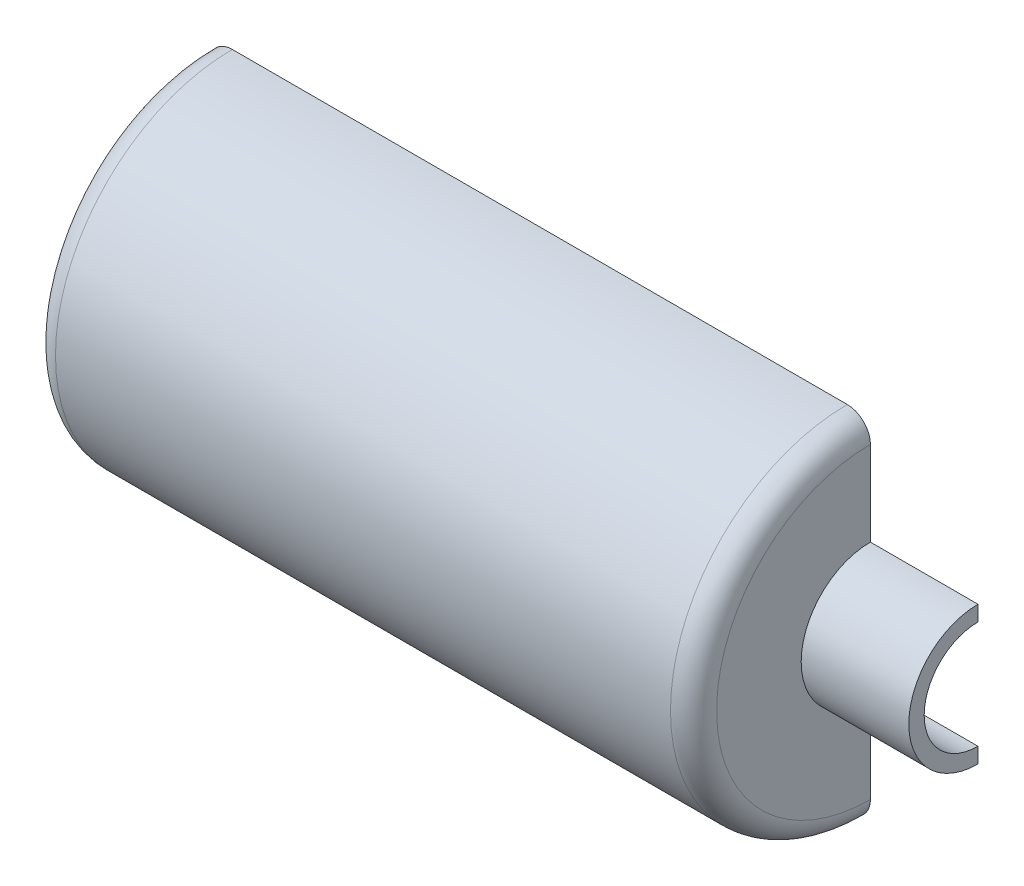
ISO-10303-21;
HEADER;
FILE_DESCRIPTION(('STEP AP214'),'2;1');
FILE_NAME('part.step','',(''),(''),'','','');
FILE_SCHEMA(('AUTOMOTIVE_DESIGN { 1 0 10303 214 1 1 1 1 }'));
ENDSEC;
DATA;
#1=APPLICATION_CONTEXT('core data for automotive mechanical design processes');
#2=APPLICATION_PROTOCOL_DEFINITION('international standard','automotive_design',2000,#1);
#3=PRODUCT_CONTEXT('',#1,'mechanical');
#4=PRODUCT('Part','Part','',(#3));
#5=PRODUCT_RELATED_PRODUCT_CATEGORY('part','',(#4));
#6=PRODUCT_DEFINITION_FORMATION('','',#4);
#7=PRODUCT_DEFINITION_CONTEXT('part definition',#1,'design');
#8=PRODUCT_DEFINITION('design','',#6,#7);
#9=PRODUCT_DEFINITION_SHAPE('','',#8);
#10=(LENGTH_UNIT() NAMED_UNIT(*) SI_UNIT(.MILLI.,.METRE.));
#11=(NAMED_UNIT(*) PLANE_ANGLE_UNIT() SI_UNIT($,.RADIAN.));
#12=(NAMED_UNIT(*) SI_UNIT($,.STERADIAN.) SOLID_ANGLE_UNIT());
#13=UNCERTAINTY_MEASURE_WITH_UNIT(LENGTH_MEASURE(1.E-05),#10,'distance_accuracy_value','');
#14=(GEOMETRIC_REPRESENTATION_CONTEXT(3) GLOBAL_UNCERTAINTY_ASSIGNED_CONTEXT((#13)) GLOBAL_UNIT_ASSIGNED_CONTEXT((#10,
#11,#12)) REPRESENTATION_CONTEXT('',''));
#15=CARTESIAN_POINT('',(0.,0.,0.));
#16=DIRECTION('',(0.,0.,1.));
#17=DIRECTION('',(1.,0.,0.));
#18=AXIS2_PLACEMENT_3D('',#15,#16,#17);
#19=CARTESIAN_POINT('',(-200.,0.,0.));
#20=DIRECTION('',(-1.,0.,0.));
#21=DIRECTION('',(0.,0.,1.));
#22=AXIS2_PLACEMENT_3D('',#19,#20,#21);
#23=PLANE('',#22);
#24=CARTESIAN_POINT('',(-200.,0.,0.));
#25=DIRECTION('',(-1.,0.,0.));
#26=DIRECTION('',(0.,0.,1.));
#27=AXIS2_PLACEMENT_3D('',#24,#25,#26);
#28=CIRCLE('',#27,92.5);
#29=CARTESIAN_POINT('',(-200.,-92.5,-6.45924047685979E-13));
#30=VERTEX_POINT('',#29);
#31=CARTESIAN_POINT('',(-200.,92.5,0.));
#32=VERTEX_POINT('',#31);
#33=EDGE_CURVE('E11',#30,#32,#28,.T.);
#34=ORIENTED_EDGE('',*,*,#33,.F.);
#35=DIRECTION('',(0.,-1.,0.));
#36=VECTOR('',#35,1.);
#37=CARTESIAN_POINT('',(-200.,0.,0.));
#38=LINE('',#37,#36);
#39=EDGE_CURVE('E123',#32,#30,#38,.T.);
#40=ORIENTED_EDGE('',*,*,#39,.F.);
#41=EDGE_LOOP('',(#34,#40));
#42=FACE_BOUND('',#41,.T.);
#43=ADVANCED_FACE('F33',(#42),#23,.F.);
#44=CARTESIAN_POINT('',(-192.5,0.,0.));
#45=DIRECTION('',(-1.,0.,0.));
#46=DIRECTION('',(0.,0.,1.));
#47=AXIS2_PLACEMENT_3D('',#44,#45,#46);
#48=TOROIDAL_SURFACE('',#47,92.5,7.50000000000001);
#49=CARTESIAN_POINT('',(-192.5,0.,0.));
#50=DIRECTION('',(-1.,0.,0.));
#51=DIRECTION('',(0.,0.,1.));
#52=AXIS2_PLACEMENT_3D('',#49,#50,#51);
#53=CIRCLE('',#52,100.);
#54=CARTESIAN_POINT('',(-192.5,-100.,-6.98296267768627E-13));
#55=VERTEX_POINT('',#54);
#56=CARTESIAN_POINT('',(-192.5,100.,0.));
#57=VERTEX_POINT('',#56);
#58=EDGE_CURVE('E40',#55,#57,#53,.T.);
#59=ORIENTED_EDGE('',*,*,#58,.F.);
#60=CARTESIAN_POINT('',(-192.5,-92.5,-6.4592404768598E-13));
#61=DIRECTION('',(0.,0.,1.));
#62=DIRECTION('',(1.,0.,0.));
#63=AXIS2_PLACEMENT_3D('',#60,#61,#62);
#64=CIRCLE('',#63,7.50000000000001);
#65=EDGE_CURVE('E128',#30,#55,#64,.T.);
#66=ORIENTED_EDGE('',*,*,#65,.F.);
#67=ORIENTED_EDGE('',*,*,#33,.T.);
#68=CARTESIAN_POINT('',(-192.5,92.5,0.));
#69=DIRECTION('',(0.,0.,-1.));
#70=DIRECTION('',(1.,0.,0.));
#71=AXIS2_PLACEMENT_3D('',#68,#69,#70);
#72=CIRCLE('',#71,7.50000000000001);
#73=EDGE_CURVE('E134',#32,#57,#72,.T.);
#74=ORIENTED_EDGE('',*,*,#73,.T.);
#75=EDGE_LOOP('',(#59,#66,#67,#74));
#76=FACE_BOUND('',#75,.T.);
#77=ADVANCED_FACE('F133',(#76),#48,.F.);
#78=CARTESIAN_POINT('',(0.,0.,0.));
#79=DIRECTION('',(-1.,0.,0.));
#80=DIRECTION('',(0.,0.,1.));
#81=AXIS2_PLACEMENT_3D('',#78,#79,#80);
#82=CYLINDRICAL_SURFACE('',#81,100.);
#83=CARTESIAN_POINT('',(192.5,0.,0.));
#84=DIRECTION('',(-1.,0.,0.));
#85=DIRECTION('',(0.,0.,1.));
#86=AXIS2_PLACEMENT_3D('',#83,#84,#85);
#87=CIRCLE('',#86,100.);
#88=CARTESIAN_POINT('',(192.5,-100.,-6.98296267768627E-13));
#89=VERTEX_POINT('',#88);
#90=CARTESIAN_POINT('',(192.5,100.,0.));
#91=VERTEX_POINT('',#90);
#92=EDGE_CURVE('E214',#89,#91,#87,.T.);
#93=ORIENTED_EDGE('',*,*,#92,.F.);
#94=DIRECTION('',(1.,0.,0.));
#95=VECTOR('',#94,1.);
#96=CARTESIAN_POINT('',(-192.5,-100.,-6.98296267768627E-13));
#97=LINE('',#96,#95);
#98=EDGE_CURVE('E168',#55,#89,#97,.T.);
#99=ORIENTED_EDGE('',*,*,#98,.F.);
#100=ORIENTED_EDGE('',*,*,#58,.T.);
#101=DIRECTION('',(1.,0.,0.));
#102=VECTOR('',#101,1.);
#103=CARTESIAN_POINT('',(-192.5,100.,0.));
#104=LINE('',#103,#102);
#105=EDGE_CURVE('E139',#57,#91,#104,.T.);
#106=ORIENTED_EDGE('',*,*,#105,.T.);
#107=EDGE_LOOP('',(#93,#99,#100,#106));
#108=FACE_BOUND('',#107,.T.);
#109=ADVANCED_FACE('F217',(#108),#82,.F.);
#110=CARTESIAN_POINT('',(192.5,0.,0.));
#111=DIRECTION('',(-1.,0.,0.));
#112=DIRECTION('',(0.,0.,1.));
#113=AXIS2_PLACEMENT_3D('',#110,#111,#112);
#114=TOROIDAL_SURFACE('',#113,92.5,7.50000000000001);
#115=CARTESIAN_POINT('',(200.,0.,0.));
#116=DIRECTION('',(-1.,0.,0.));
#117=DIRECTION('',(0.,0.,1.));
#118=AXIS2_PLACEMENT_3D('',#115,#116,#117);
#119=CIRCLE('',#118,92.5);
#120=CARTESIAN_POINT('',(200.,-92.5,-6.45924047685979E-13));
#121=VERTEX_POINT('',#120);
#122=CARTESIAN_POINT('',(200.,92.5,0.));
#123=VERTEX_POINT('',#122);
#124=EDGE_CURVE('E212',#121,#123,#119,.T.);
#125=ORIENTED_EDGE('',*,*,#124,.F.);
#126=CARTESIAN_POINT('',(192.5,-92.5,-6.4592404768598E-13));
#127=DIRECTION('',(0.,0.,1.));
#128=DIRECTION('',(1.,0.,0.));
#129=AXIS2_PLACEMENT_3D('',#126,#127,#128);
#130=CIRCLE('',#129,7.50000000000001);
#131=EDGE_CURVE('E171',#89,#121,#130,.T.);
#132=ORIENTED_EDGE('',*,*,#131,.F.);
#133=ORIENTED_EDGE('',*,*,#92,.T.);
#134=CARTESIAN_POINT('',(192.5,92.5,0.));
#135=DIRECTION('',(0.,0.,-1.));
#136=DIRECTION('',(1.,0.,0.));
#137=AXIS2_PLACEMENT_3D('',#134,#135,#136);
#138=CIRCLE('',#137,7.50000000000001);
#139=EDGE_CURVE('E141',#91,#123,#138,.T.);
#140=ORIENTED_EDGE('',*,*,#139,.T.);
#141=EDGE_LOOP('',(#125,#132,#133,#140));
#142=FACE_BOUND('',#141,.T.);
#143=ADVANCED_FACE('F221',(#142),#114,.F.);
#144=CARTESIAN_POINT('',(200.,-92.5,-6.45924047685979E-13));
#145=DIRECTION('',(1.,0.,0.));
#146=DIRECTION('',(0.,0.,-1.));
#147=AXIS2_PLACEMENT_3D('',#144,#145,#146);
#148=PLANE('',#147);
#149=CARTESIAN_POINT('',(200.,0.,0.));
#150=DIRECTION('',(-1.,0.,0.));
#151=DIRECTION('',(0.,0.,1.));
#152=AXIS2_PLACEMENT_3D('',#149,#150,#151);
#153=CIRCLE('',#152,35.);
#154=CARTESIAN_POINT('',(200.,-35.,-2.44403693719019E-13));
#155=VERTEX_POINT('',#154);
#156=CARTESIAN_POINT('',(200.,35.,0.));
#157=VERTEX_POINT('',#156);
#158=EDGE_CURVE('E210',#155,#157,#153,.T.);
#159=ORIENTED_EDGE('',*,*,#158,.F.);
#160=DIRECTION('',(0.,1.,0.));
#161=VECTOR('',#160,1.);
#162=CARTESIAN_POINT('',(200.,-92.5,-6.45924047685979E-13));
#163=LINE('',#162,#161);
#164=EDGE_CURVE('E174',#121,#155,#163,.T.);
#165=ORIENTED_EDGE('',*,*,#164,.F.);
#166=ORIENTED_EDGE('',*,*,#124,.T.);
#167=DIRECTION('',(0.,-1.,0.));
#168=VECTOR('',#167,1.);
#169=CARTESIAN_POINT('',(200.,92.5,0.));
#170=LINE('',#169,#168);
#171=EDGE_CURVE('E146',#123,#157,#170,.T.);
#172=ORIENTED_EDGE('',*,*,#171,.T.);
#173=EDGE_LOOP('',(#159,#165,#166,#172));
#174=FACE_BOUND('',#173,.T.);
#175=ADVANCED_FACE('F224',(#174),#148,.F.);
#176=CARTESIAN_POINT('',(0.,0.,0.));
#177=DIRECTION('',(-1.,0.,0.));
#178=DIRECTION('',(0.,0.,1.));
#179=AXIS2_PLACEMENT_3D('',#176,#177,#178);
#180=CYLINDRICAL_SURFACE('',#179,35.);
#181=CARTESIAN_POINT('',(285.,0.,0.));
#182=DIRECTION('',(-1.,0.,0.));
#183=DIRECTION('',(0.,0.,1.));
#184=AXIS2_PLACEMENT_3D('',#181,#182,#183);
#185=CIRCLE('',#184,35.);
#186=CARTESIAN_POINT('',(285.,-35.,-2.44403693719019E-13));
#187=VERTEX_POINT('',#186);
#188=CARTESIAN_POINT('',(285.,35.,0.));
#189=VERTEX_POINT('',#188);
#190=EDGE_CURVE('E208',#187,#189,#185,.T.);
#191=ORIENTED_EDGE('',*,*,#190,.F.);
#192=DIRECTION('',(1.,0.,0.));
#193=VECTOR('',#192,1.);
#194=CARTESIAN_POINT('',(200.,-35.,-2.44403693719019E-13));
#195=LINE('',#194,#193);
#196=EDGE_CURVE('E177',#155,#187,#195,.T.);
#197=ORIENTED_EDGE('',*,*,#196,.F.);
#198=ORIENTED_EDGE('',*,*,#158,.T.);
#199=DIRECTION('',(1.,0.,0.));
#200=VECTOR('',#199,1.);
#201=CARTESIAN_POINT('',(200.,35.,0.));
#202=LINE('',#201,#200);
#203=EDGE_CURVE('E149',#157,#189,#202,.T.);
#204=ORIENTED_EDGE('',*,*,#203,.T.);
#205=EDGE_LOOP('',(#191,#197,#198,#204));
#206=FACE_BOUND('',#205,.T.);
#207=ADVANCED_FACE('F229',(#206),#180,.F.);
#208=CARTESIAN_POINT('',(285.,-35.,-2.44403693719019E-13));
#209=DIRECTION('',(-1.,0.,0.));
#210=DIRECTION('',(0.,0.,1.));
#211=AXIS2_PLACEMENT_3D('',#208,#209,#210);
#212=PLANE('',#211);
#213=CARTESIAN_POINT('',(285.,0.,0.));
#214=DIRECTION('',(-1.,0.,0.));
#215=DIRECTION('',(0.,0.,1.));
#216=AXIS2_PLACEMENT_3D('',#213,#214,#215);
#217=CIRCLE('',#216,45.);
#218=CARTESIAN_POINT('',(285.,-45.,-3.14233320495882E-13));
#219=VERTEX_POINT('',#218);
#220=CARTESIAN_POINT('',(285.,45.,0.));
#221=VERTEX_POINT('',#220);
#222=EDGE_CURVE('E206',#219,#221,#217,.T.);
#223=ORIENTED_EDGE('',*,*,#222,.F.);
#224=DIRECTION('',(0.,-1.,0.));
#225=VECTOR('',#224,1.);
#226=CARTESIAN_POINT('',(285.,-35.,-2.44403693719019E-13));
#227=LINE('',#226,#225);
#228=EDGE_CURVE('E180',#187,#219,#227,.T.);
#229=ORIENTED_EDGE('',*,*,#228,.F.);
#230=ORIENTED_EDGE('',*,*,#190,.T.);
#231=DIRECTION('',(0.,1.,0.));
#232=VECTOR('',#231,1.);
#233=CARTESIAN_POINT('',(285.,35.,0.));
#234=LINE('',#233,#232);
#235=EDGE_CURVE('E152',#189,#221,#234,.T.);
#236=ORIENTED_EDGE('',*,*,#235,.T.);
#237=EDGE_LOOP('',(#223,#229,#230,#236));
#238=FACE_BOUND('',#237,.T.);
#239=ADVANCED_FACE('F232',(#238),#212,.F.);
#240=CARTESIAN_POINT('',(0.,0.,0.));
#241=DIRECTION('',(-1.,0.,0.));
#242=DIRECTION('',(0.,0.,1.));
#243=AXIS2_PLACEMENT_3D('',#240,#241,#242);
#244=CYLINDRICAL_SURFACE('',#243,45.);
#245=CARTESIAN_POINT('',(215.,0.,0.));
#246=DIRECTION('',(-1.,0.,0.));
#247=DIRECTION('',(0.,0.,1.));
#248=AXIS2_PLACEMENT_3D('',#245,#246,#247);
#249=CIRCLE('',#248,45.);
#250=CARTESIAN_POINT('',(215.,-45.,-3.14233320495882E-13));
#251=VERTEX_POINT('',#250);
#252=CARTESIAN_POINT('',(215.,45.,0.));
#253=VERTEX_POINT('',#252);
#254=EDGE_CURVE('E204',#251,#253,#249,.T.);
#255=ORIENTED_EDGE('',*,*,#254,.F.);
#256=DIRECTION('',(-1.,0.,0.));
#257=VECTOR('',#256,1.);
#258=CARTESIAN_POINT('',(215.,-45.,-3.14233320495882E-13));
#259=LINE('',#258,#257);
#260=EDGE_CURVE('E183',#219,#251,#259,.T.);
#261=ORIENTED_EDGE('',*,*,#260,.F.);
#262=ORIENTED_EDGE('',*,*,#222,.T.);
#263=DIRECTION('',(-1.,0.,0.));
#264=VECTOR('',#263,1.);
#265=CARTESIAN_POINT('',(215.,45.,0.));
#266=LINE('',#265,#264);
#267=EDGE_CURVE('E155',#221,#253,#266,.T.);
#268=ORIENTED_EDGE('',*,*,#267,.T.);
#269=EDGE_LOOP('',(#255,#261,#262,#268));
#270=FACE_BOUND('',#269,.T.);
#271=ADVANCED_FACE('F237',(#270),#244,.T.);
#272=CARTESIAN_POINT('',(215.,-99.9999999999999,-6.98296267768626E-13));
#273=DIRECTION('',(-1.,0.,0.));
#274=DIRECTION('',(0.,0.,1.));
#275=AXIS2_PLACEMENT_3D('',#272,#273,#274);
#276=PLANE('',#275);
#277=CARTESIAN_POINT('',(215.,0.,0.));
#278=DIRECTION('',(-1.,0.,0.));
#279=DIRECTION('',(0.,0.,1.));
#280=AXIS2_PLACEMENT_3D('',#277,#278,#279);
#281=CIRCLE('',#280,99.9999999999999);
#282=CARTESIAN_POINT('',(215.,-99.9999999999999,-6.98296267768626E-13));
#283=VERTEX_POINT('',#282);
#284=CARTESIAN_POINT('',(215.,99.9999999999999,0.));
#285=VERTEX_POINT('',#284);
#286=EDGE_CURVE('E202',#283,#285,#281,.T.);
#287=ORIENTED_EDGE('',*,*,#286,.F.);
#288=DIRECTION('',(0.,-1.,0.));
#289=VECTOR('',#288,1.);
#290=CARTESIAN_POINT('',(215.,-99.9999999999999,-6.98296267768626E-13));
#291=LINE('',#290,#289);
#292=EDGE_CURVE('E186',#251,#283,#291,.T.);
#293=ORIENTED_EDGE('',*,*,#292,.F.);
#294=ORIENTED_EDGE('',*,*,#254,.T.);
#295=DIRECTION('',(0.,1.,0.));
#296=VECTOR('',#295,1.);
#297=CARTESIAN_POINT('',(215.,99.9999999999999,0.));
#298=LINE('',#297,#296);
#299=EDGE_CURVE('E158',#253,#285,#298,.T.);
#300=ORIENTED_EDGE('',*,*,#299,.T.);
#301=EDGE_LOOP('',(#287,#293,#294,#300));
#302=FACE_BOUND('',#301,.T.);
#303=ADVANCED_FACE('F240',(#302),#276,.F.);
#304=CARTESIAN_POINT('',(200.,0.,0.));
#305=DIRECTION('',(-1.,0.,0.));
#306=DIRECTION('',(0.,0.,1.));
#307=AXIS2_PLACEMENT_3D('',#304,#305,#306);
#308=TOROIDAL_SURFACE('',#307,100.,15.);
#309=CARTESIAN_POINT('',(200.,0.,0.));
#310=DIRECTION('',(-1.,0.,0.));
#311=DIRECTION('',(0.,0.,1.));
#312=AXIS2_PLACEMENT_3D('',#309,#310,#311);
#313=CIRCLE('',#312,115.);
#314=CARTESIAN_POINT('',(200.,-115.,-8.03040707933921E-13));
#315=VERTEX_POINT('',#314);
#316=CARTESIAN_POINT('',(200.,115.,0.));
#317=VERTEX_POINT('',#316);
#318=EDGE_CURVE('E200',#315,#317,#313,.T.);
#319=ORIENTED_EDGE('',*,*,#318,.F.);
#320=CARTESIAN_POINT('',(200.,-100.,-6.98296267768627E-13));
#321=DIRECTION('',(0.,0.,-1.));
#322=DIRECTION('',(1.,0.,0.));
#323=AXIS2_PLACEMENT_3D('',#320,#321,#322);
#324=CIRCLE('',#323,15.);
#325=EDGE_CURVE('E189',#283,#315,#324,.T.);
#326=ORIENTED_EDGE('',*,*,#325,.F.);
#327=ORIENTED_EDGE('',*,*,#286,.T.);
#328=CARTESIAN_POINT('',(200.,100.,0.));
#329=DIRECTION('',(0.,0.,1.));
#330=DIRECTION('',(1.,0.,0.));
#331=AXIS2_PLACEMENT_3D('',#328,#329,#330);
#332=CIRCLE('',#331,15.);
#333=EDGE_CURVE('E161',#285,#317,#332,.T.);
#334=ORIENTED_EDGE('',*,*,#333,.T.);
#335=EDGE_LOOP('',(#319,#326,#327,#334));
#336=FACE_BOUND('',#335,.T.);
#337=ADVANCED_FACE('F244',(#336),#308,.T.);
#338=CARTESIAN_POINT('',(0.,0.,0.));
#339=DIRECTION('',(-1.,0.,0.));
#340=DIRECTION('',(0.,0.,1.));
#341=AXIS2_PLACEMENT_3D('',#338,#339,#340);
#342=CYLINDRICAL_SURFACE('',#341,115.);
#343=CARTESIAN_POINT('',(-200.,0.,0.));
#344=DIRECTION('',(-1.,0.,0.));
#345=DIRECTION('',(0.,0.,1.));
#346=AXIS2_PLACEMENT_3D('',#343,#344,#345);
#347=CIRCLE('',#346,115.);
#348=CARTESIAN_POINT('',(-200.,-115.,-8.03040707933921E-13));
#349=VERTEX_POINT('',#348);
#350=CARTESIAN_POINT('',(-200.,115.,0.));
#351=VERTEX_POINT('',#350);
#352=EDGE_CURVE('E55',#349,#351,#347,.T.);
#353=ORIENTED_EDGE('',*,*,#352,.F.);
#354=DIRECTION('',(-1.,0.,0.));
#355=VECTOR('',#354,1.);
#356=CARTESIAN_POINT('',(-200.,-115.,-8.03040707933921E-13));
#357=LINE('',#356,#355);
#358=EDGE_CURVE('E192',#315,#349,#357,.T.);
#359=ORIENTED_EDGE('',*,*,#358,.F.);
#360=ORIENTED_EDGE('',*,*,#318,.T.);
#361=DIRECTION('',(-1.,0.,0.));
#362=VECTOR('',#361,1.);
#363=CARTESIAN_POINT('',(-200.,115.,0.));
#364=LINE('',#363,#362);
#365=EDGE_CURVE('E164',#317,#351,#364,.T.);
#366=ORIENTED_EDGE('',*,*,#365,.T.);
#367=EDGE_LOOP('',(#353,#359,#360,#366));
#368=FACE_BOUND('',#367,.T.);
#369=ADVANCED_FACE('F246',(#368),#342,.T.);
#370=CARTESIAN_POINT('',(-200.,0.,0.));
#371=DIRECTION('',(-1.,0.,0.));
#372=DIRECTION('',(0.,0.,1.));
#373=AXIS2_PLACEMENT_3D('',#370,#371,#372);
#374=TOROIDAL_SURFACE('',#373,100.,15.);
#375=CARTESIAN_POINT('',(-215.,0.,0.));
#376=DIRECTION('',(-1.,0.,0.));
#377=DIRECTION('',(0.,0.,1.));
#378=AXIS2_PLACEMENT_3D('',#375,#376,#377);
#379=CIRCLE('',#378,99.9999999999999);
#380=CARTESIAN_POINT('',(-215.,-99.9999999999999,-6.98296267768626E-13));
#381=VERTEX_POINT('',#380);
#382=CARTESIAN_POINT('',(-215.,99.9999999999999,0.));
#383=VERTEX_POINT('',#382);
#384=EDGE_CURVE('E47',#381,#383,#379,.T.);
#385=ORIENTED_EDGE('',*,*,#384,.F.);
#386=CARTESIAN_POINT('',(-200.,-100.,-6.98296267768627E-13));
#387=DIRECTION('',(0.,0.,-1.));
#388=DIRECTION('',(-1.,0.,0.));
#389=AXIS2_PLACEMENT_3D('',#386,#387,#388);
#390=CIRCLE('',#389,15.);
#391=EDGE_CURVE('E194',#349,#381,#390,.T.);
#392=ORIENTED_EDGE('',*,*,#391,.F.);
#393=ORIENTED_EDGE('',*,*,#352,.T.);
#394=CARTESIAN_POINT('',(-200.,100.,0.));
#395=DIRECTION('',(0.,0.,1.));
#396=DIRECTION('',(-1.,0.,0.));
#397=AXIS2_PLACEMENT_3D('',#394,#395,#396);
#398=CIRCLE('',#397,15.);
#399=EDGE_CURVE('E129',#351,#383,#398,.T.);
#400=ORIENTED_EDGE('',*,*,#399,.T.);
#401=EDGE_LOOP('',(#385,#392,#393,#400));
#402=FACE_BOUND('',#401,.T.);
#403=ADVANCED_FACE('F249',(#402),#374,.T.);
#404=CARTESIAN_POINT('',(-215.,0.,0.));
#405=DIRECTION('',(1.,0.,0.));
#406=DIRECTION('',(0.,0.,-1.));
#407=AXIS2_PLACEMENT_3D('',#404,#405,#406);
#408=PLANE('',#407);
#409=DIRECTION('',(0.,1.,0.));
#410=VECTOR('',#409,1.);
#411=CARTESIAN_POINT('',(-215.,0.,0.));
#412=LINE('',#411,#410);
#413=EDGE_CURVE('E196',#381,#383,#412,.T.);
#414=ORIENTED_EDGE('',*,*,#413,.F.);
#415=ORIENTED_EDGE('',*,*,#384,.T.);
#416=EDGE_LOOP('',(#414,#415));
#417=FACE_BOUND('',#416,.T.);
#418=ADVANCED_FACE('F251',(#417),#408,.F.);
#419=CARTESIAN_POINT('',(-192.5,-92.5,-6.4592404768598E-13));
#420=DIRECTION('',(0.,0.,-1.));
#421=DIRECTION('',(1.,0.,0.));
#422=AXIS2_PLACEMENT_3D('',#419,#420,#421);
#423=PLANE('',#422);
#424=ORIENTED_EDGE('',*,*,#413,.T.);
#425=ORIENTED_EDGE('',*,*,#399,.F.);
#426=ORIENTED_EDGE('',*,*,#365,.F.);
#427=ORIENTED_EDGE('',*,*,#333,.F.);
#428=ORIENTED_EDGE('',*,*,#299,.F.);
#429=ORIENTED_EDGE('',*,*,#267,.F.);
#430=ORIENTED_EDGE('',*,*,#235,.F.);
#431=ORIENTED_EDGE('',*,*,#203,.F.);
#432=ORIENTED_EDGE('',*,*,#171,.F.);
#433=ORIENTED_EDGE('',*,*,#139,.F.);
#434=ORIENTED_EDGE('',*,*,#105,.F.);
#435=ORIENTED_EDGE('',*,*,#73,.F.);
#436=ORIENTED_EDGE('',*,*,#39,.T.);
#437=ORIENTED_EDGE('',*,*,#65,.T.);
#438=ORIENTED_EDGE('',*,*,#98,.T.);
#439=ORIENTED_EDGE('',*,*,#131,.T.);
#440=ORIENTED_EDGE('',*,*,#164,.T.);
#441=ORIENTED_EDGE('',*,*,#196,.T.);
#442=ORIENTED_EDGE('',*,*,#228,.T.);
#443=ORIENTED_EDGE('',*,*,#260,.T.);
#444=ORIENTED_EDGE('',*,*,#292,.T.);
#445=ORIENTED_EDGE('',*,*,#325,.T.);
#446=ORIENTED_EDGE('',*,*,#358,.T.);
#447=ORIENTED_EDGE('',*,*,#391,.T.);
#448=EDGE_LOOP('',(#424,#425,#426,#427,#428,#429,#430,#431,#432,#433,#434,#435,#436,#437,#438,
#439,#440,#441,#442,#443,#444,#445,#446,#447));
#449=FACE_BOUND('',#448,.T.);
#450=ADVANCED_FACE('F136',(#449),#423,.T.);
#451=CLOSED_SHELL('',(#43,#77,#109,#143,#175,#207,#239,#271,#303,#337,#369,#403,#418,#450));
#452=MANIFOLD_SOLID_BREP('B2',#451);
#453=ADVANCED_BREP_SHAPE_REPRESENTATION('',(#18,#452),#14);
#454=SHAPE_DEFINITION_REPRESENTATION(#9,#453);
ENDSEC;
END-ISO-10303-21;
